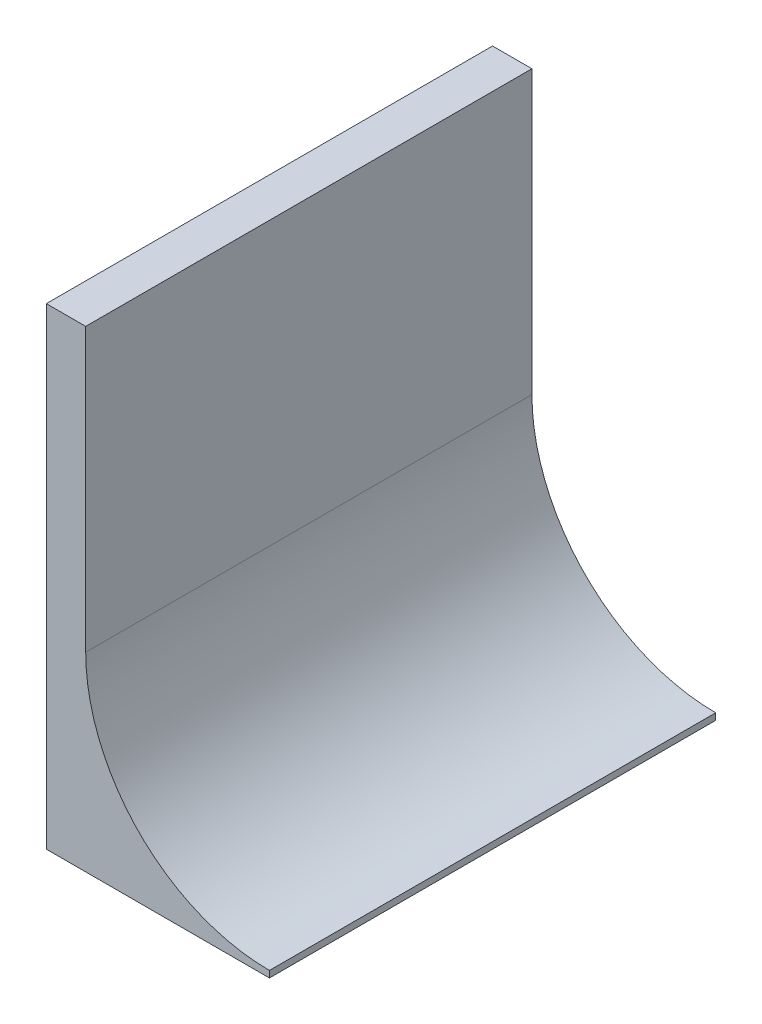
ISO-10303-21;
HEADER;
FILE_DESCRIPTION(('STEP AP214'),'2;1');
FILE_NAME('part.step','',(''),(''),'','','');
FILE_SCHEMA(('AUTOMOTIVE_DESIGN { 1 0 10303 214 1 1 1 1 }'));
ENDSEC;
DATA;
#1=APPLICATION_CONTEXT('core data for automotive mechanical design processes');
#2=APPLICATION_PROTOCOL_DEFINITION('international standard','automotive_design',2000,#1);
#3=PRODUCT_CONTEXT('',#1,'mechanical');
#4=PRODUCT('Part','Part','',(#3));
#5=PRODUCT_RELATED_PRODUCT_CATEGORY('part','',(#4));
#6=PRODUCT_DEFINITION_FORMATION('','',#4);
#7=PRODUCT_DEFINITION_CONTEXT('part definition',#1,'design');
#8=PRODUCT_DEFINITION('design','',#6,#7);
#9=PRODUCT_DEFINITION_SHAPE('','',#8);
#10=(LENGTH_UNIT() NAMED_UNIT(*) SI_UNIT(.MILLI.,.METRE.));
#11=(NAMED_UNIT(*) PLANE_ANGLE_UNIT() SI_UNIT($,.RADIAN.));
#12=(NAMED_UNIT(*) SI_UNIT($,.STERADIAN.) SOLID_ANGLE_UNIT());
#13=UNCERTAINTY_MEASURE_WITH_UNIT(LENGTH_MEASURE(1.E-05),#10,'distance_accuracy_value','');
#14=(GEOMETRIC_REPRESENTATION_CONTEXT(3) GLOBAL_UNCERTAINTY_ASSIGNED_CONTEXT((#13)) GLOBAL_UNIT_ASSIGNED_CONTEXT((#10,
#11,#12)) REPRESENTATION_CONTEXT('',''));
#15=CARTESIAN_POINT('',(0.,0.,0.));
#16=DIRECTION('',(0.,0.,1.));
#17=DIRECTION('',(1.,0.,0.));
#18=AXIS2_PLACEMENT_3D('',#15,#16,#17);
#19=CARTESIAN_POINT('',(-252.995998982065,139.7,-107.95));
#20=DIRECTION('',(0.,0.,1.));
#21=DIRECTION('',(0.,-1.,0.));
#22=AXIS2_PLACEMENT_3D('',#19,#20,#21);
#23=PLANE('',#22);
#24=DIRECTION('',(0.,1.,0.));
#25=VECTOR('',#24,1.);
#26=CARTESIAN_POINT('',(-379.995998982065,139.7,-107.95));
#27=LINE('',#26,#25);
#28=CARTESIAN_POINT('',(-379.995998982065,-139.7,-107.95));
#29=VERTEX_POINT('',#28);
#30=CARTESIAN_POINT('',(-379.995998982065,88.9000000000001,-107.95));
#31=VERTEX_POINT('',#30);
#32=EDGE_CURVE('E120',#29,#31,#27,.T.);
#33=ORIENTED_EDGE('',*,*,#32,.T.);
#34=DIRECTION('',(1.,0.,0.));
#35=VECTOR('',#34,1.);
#36=CARTESIAN_POINT('',(-379.995998982065,88.9000000000001,-107.95));
#37=LINE('',#36,#35);
#38=CARTESIAN_POINT('',(-360.945998982065,88.9000000000001,-107.95));
#39=VERTEX_POINT('',#38);
#40=EDGE_CURVE('E49',#31,#39,#37,.T.);
#41=ORIENTED_EDGE('',*,*,#40,.T.);
#42=DIRECTION('',(0.,-1.,0.));
#43=VECTOR('',#42,1.);
#44=CARTESIAN_POINT('',(-360.945998982065,88.9000000000001,-107.95));
#45=LINE('',#44,#43);
#46=CARTESIAN_POINT('',(-360.945998982065,-47.6249999999999,-107.95));
#47=VERTEX_POINT('',#46);
#48=EDGE_CURVE('E98',#39,#47,#45,.T.);
#49=ORIENTED_EDGE('',*,*,#48,.T.);
#50=CARTESIAN_POINT('',(-272.045998982065,-47.6249999999999,-107.95));
#51=DIRECTION('',(0.,0.,1.));
#52=DIRECTION('',(1.,0.,0.));
#53=AXIS2_PLACEMENT_3D('',#50,#51,#52);
#54=CIRCLE('',#53,88.9);
#55=CARTESIAN_POINT('',(-272.045998982065,-136.525,-107.95));
#56=VERTEX_POINT('',#55);
#57=EDGE_CURVE('E91',#47,#56,#54,.T.);
#58=ORIENTED_EDGE('',*,*,#57,.T.);
#59=DIRECTION('',(0.,-1.,0.));
#60=VECTOR('',#59,1.);
#61=CARTESIAN_POINT('',(-272.045998982065,-136.525,-107.95));
#62=LINE('',#61,#60);
#63=CARTESIAN_POINT('',(-272.045998982065,-139.7,-107.95));
#64=VERTEX_POINT('',#63);
#65=EDGE_CURVE('E100',#56,#64,#62,.T.);
#66=ORIENTED_EDGE('',*,*,#65,.T.);
#67=DIRECTION('',(-1.,0.,0.));
#68=VECTOR('',#67,1.);
#69=CARTESIAN_POINT('',(-252.995998982065,-139.7,-107.95));
#70=LINE('',#69,#68);
#71=EDGE_CURVE('E42',#64,#29,#70,.T.);
#72=ORIENTED_EDGE('',*,*,#71,.T.);
#73=EDGE_LOOP('',(#33,#41,#49,#58,#66,#72));
#74=FACE_BOUND('',#73,.T.);
#75=ADVANCED_FACE('F35',(#74),#23,.F.);
#76=CARTESIAN_POINT('',(-252.995998982065,139.7,107.95));
#77=DIRECTION('',(0.,0.,-1.));
#78=DIRECTION('',(0.,1.,0.));
#79=AXIS2_PLACEMENT_3D('',#76,#77,#78);
#80=PLANE('',#79);
#81=DIRECTION('',(0.,-1.,0.));
#82=VECTOR('',#81,1.);
#83=CARTESIAN_POINT('',(-360.945998982065,88.9000000000001,107.95));
#84=LINE('',#83,#82);
#85=CARTESIAN_POINT('',(-360.945998982065,88.9000000000001,107.95));
#86=VERTEX_POINT('',#85);
#87=CARTESIAN_POINT('',(-360.945998982065,-47.6249999999999,107.95));
#88=VERTEX_POINT('',#87);
#89=EDGE_CURVE('E105',#86,#88,#84,.T.);
#90=ORIENTED_EDGE('',*,*,#89,.F.);
#91=DIRECTION('',(1.,0.,0.));
#92=VECTOR('',#91,1.);
#93=CARTESIAN_POINT('',(-379.995998982065,88.9000000000001,107.95));
#94=LINE('',#93,#92);
#95=CARTESIAN_POINT('',(-379.995998982065,88.9000000000001,107.95));
#96=VERTEX_POINT('',#95);
#97=EDGE_CURVE('E108',#96,#86,#94,.T.);
#98=ORIENTED_EDGE('',*,*,#97,.F.);
#99=DIRECTION('',(0.,-1.,0.));
#100=VECTOR('',#99,1.);
#101=CARTESIAN_POINT('',(-379.995998982065,139.7,107.95));
#102=LINE('',#101,#100);
#103=CARTESIAN_POINT('',(-379.995998982065,-139.7,107.95));
#104=VERTEX_POINT('',#103);
#105=EDGE_CURVE('E127',#96,#104,#102,.T.);
#106=ORIENTED_EDGE('',*,*,#105,.T.);
#107=DIRECTION('',(-1.,0.,0.));
#108=VECTOR('',#107,1.);
#109=CARTESIAN_POINT('',(-252.995998982065,-139.7,107.95));
#110=LINE('',#109,#108);
#111=CARTESIAN_POINT('',(-272.045998982065,-139.7,107.95));
#112=VERTEX_POINT('',#111);
#113=EDGE_CURVE('E11',#112,#104,#110,.T.);
#114=ORIENTED_EDGE('',*,*,#113,.F.);
#115=DIRECTION('',(0.,-1.,0.));
#116=VECTOR('',#115,1.);
#117=CARTESIAN_POINT('',(-272.045998982065,-136.525,107.95));
#118=LINE('',#117,#116);
#119=CARTESIAN_POINT('',(-272.045998982065,-136.525,107.95));
#120=VERTEX_POINT('',#119);
#121=EDGE_CURVE('E114',#120,#112,#118,.T.);
#122=ORIENTED_EDGE('',*,*,#121,.F.);
#123=CARTESIAN_POINT('',(-272.045998982065,-47.6249999999999,107.95));
#124=DIRECTION('',(0.,0.,1.));
#125=DIRECTION('',(1.,0.,0.));
#126=AXIS2_PLACEMENT_3D('',#123,#124,#125);
#127=CIRCLE('',#126,88.9);
#128=EDGE_CURVE('E94',#88,#120,#127,.T.);
#129=ORIENTED_EDGE('',*,*,#128,.F.);
#130=EDGE_LOOP('',(#90,#98,#106,#114,#122,#129));
#131=FACE_BOUND('',#130,.T.);
#132=ADVANCED_FACE('F143',(#131),#80,.F.);
#133=CARTESIAN_POINT('',(-252.995998982065,-139.7,107.95));
#134=DIRECTION('',(0.,1.,0.));
#135=DIRECTION('',(0.,0.,1.));
#136=AXIS2_PLACEMENT_3D('',#133,#134,#135);
#137=PLANE('',#136);
#138=ORIENTED_EDGE('',*,*,#71,.F.);
#139=DIRECTION('',(0.,0.,1.));
#140=VECTOR('',#139,1.);
#141=CARTESIAN_POINT('',(-272.045998982065,-139.7,-107.95));
#142=LINE('',#141,#140);
#143=EDGE_CURVE('E97',#64,#112,#142,.T.);
#144=ORIENTED_EDGE('',*,*,#143,.T.);
#145=ORIENTED_EDGE('',*,*,#113,.T.);
#146=DIRECTION('',(0.,0.,-1.));
#147=VECTOR('',#146,1.);
#148=CARTESIAN_POINT('',(-379.995998982065,-139.7,107.95));
#149=LINE('',#148,#147);
#150=EDGE_CURVE('E130',#104,#29,#149,.T.);
#151=ORIENTED_EDGE('',*,*,#150,.T.);
#152=EDGE_LOOP('',(#138,#144,#145,#151));
#153=FACE_BOUND('',#152,.T.);
#154=ADVANCED_FACE('F134',(#153),#137,.F.);
#155=CARTESIAN_POINT('',(-379.995998982065,0.,0.));
#156=DIRECTION('',(1.,0.,0.));
#157=DIRECTION('',(0.,0.,-1.));
#158=AXIS2_PLACEMENT_3D('',#155,#156,#157);
#159=PLANE('',#158);
#160=ORIENTED_EDGE('',*,*,#105,.F.);
#161=DIRECTION('',(0.,0.,1.));
#162=VECTOR('',#161,1.);
#163=CARTESIAN_POINT('',(-379.995998982065,88.9000000000001,-107.95));
#164=LINE('',#163,#162);
#165=EDGE_CURVE('E123',#31,#96,#164,.T.);
#166=ORIENTED_EDGE('',*,*,#165,.F.);
#167=ORIENTED_EDGE('',*,*,#32,.F.);
#168=ORIENTED_EDGE('',*,*,#150,.F.);
#169=EDGE_LOOP('',(#160,#166,#167,#168));
#170=FACE_BOUND('',#169,.T.);
#171=ADVANCED_FACE('F138',(#170),#159,.F.);
#172=CARTESIAN_POINT('',(-272.045998982065,-47.6249999999999,-107.95));
#173=DIRECTION('',(0.,0.,1.));
#174=DIRECTION('',(1.,0.,0.));
#175=AXIS2_PLACEMENT_3D('',#172,#173,#174);
#176=CYLINDRICAL_SURFACE('',#175,88.9);
#177=ORIENTED_EDGE('',*,*,#128,.T.);
#178=DIRECTION('',(0.,0.,1.));
#179=VECTOR('',#178,1.);
#180=CARTESIAN_POINT('',(-272.045998982065,-136.525,-107.95));
#181=LINE('',#180,#179);
#182=EDGE_CURVE('E87',#56,#120,#181,.T.);
#183=ORIENTED_EDGE('',*,*,#182,.F.);
#184=ORIENTED_EDGE('',*,*,#57,.F.);
#185=DIRECTION('',(0.,0.,1.));
#186=VECTOR('',#185,1.);
#187=CARTESIAN_POINT('',(-360.945998982065,-47.6249999999999,-107.95));
#188=LINE('',#187,#186);
#189=EDGE_CURVE('E118',#47,#88,#188,.T.);
#190=ORIENTED_EDGE('',*,*,#189,.T.);
#191=EDGE_LOOP('',(#177,#183,#184,#190));
#192=FACE_BOUND('',#191,.T.);
#193=ADVANCED_FACE('F89',(#192),#176,.F.);
#194=CARTESIAN_POINT('',(-360.945998982065,88.9000000000001,-107.95));
#195=DIRECTION('',(-1.,0.,0.));
#196=DIRECTION('',(0.,0.,1.));
#197=AXIS2_PLACEMENT_3D('',#194,#195,#196);
#198=PLANE('',#197);
#199=ORIENTED_EDGE('',*,*,#89,.T.);
#200=ORIENTED_EDGE('',*,*,#189,.F.);
#201=ORIENTED_EDGE('',*,*,#48,.F.);
#202=DIRECTION('',(0.,0.,1.));
#203=VECTOR('',#202,1.);
#204=CARTESIAN_POINT('',(-360.945998982065,88.9000000000001,-107.95));
#205=LINE('',#204,#203);
#206=EDGE_CURVE('E121',#39,#86,#205,.T.);
#207=ORIENTED_EDGE('',*,*,#206,.T.);
#208=EDGE_LOOP('',(#199,#200,#201,#207));
#209=FACE_BOUND('',#208,.T.);
#210=ADVANCED_FACE('F145',(#209),#198,.F.);
#211=CARTESIAN_POINT('',(-379.995998982065,88.9000000000001,-107.95));
#212=DIRECTION('',(0.,-1.,0.));
#213=DIRECTION('',(0.,0.,-1.));
#214=AXIS2_PLACEMENT_3D('',#211,#212,#213);
#215=PLANE('',#214);
#216=ORIENTED_EDGE('',*,*,#97,.T.);
#217=ORIENTED_EDGE('',*,*,#206,.F.);
#218=ORIENTED_EDGE('',*,*,#40,.F.);
#219=ORIENTED_EDGE('',*,*,#165,.T.);
#220=EDGE_LOOP('',(#216,#217,#218,#219));
#221=FACE_BOUND('',#220,.T.);
#222=ADVANCED_FACE('F140',(#221),#215,.F.);
#223=CARTESIAN_POINT('',(-272.045998982065,-136.525,-107.95));
#224=DIRECTION('',(-1.,0.,0.));
#225=DIRECTION('',(0.,-1.,0.));
#226=AXIS2_PLACEMENT_3D('',#223,#224,#225);
#227=PLANE('',#226);
#228=ORIENTED_EDGE('',*,*,#121,.T.);
#229=ORIENTED_EDGE('',*,*,#143,.F.);
#230=ORIENTED_EDGE('',*,*,#65,.F.);
#231=ORIENTED_EDGE('',*,*,#182,.T.);
#232=EDGE_LOOP('',(#228,#229,#230,#231));
#233=FACE_BOUND('',#232,.T.);
#234=ADVANCED_FACE('F101',(#233),#227,.F.);
#235=CLOSED_SHELL('',(#75,#132,#154,#171,#193,#210,#222,#234));
#236=MANIFOLD_SOLID_BREP('B2',#235);
#237=ADVANCED_BREP_SHAPE_REPRESENTATION('',(#18,#236),#14);
#238=SHAPE_DEFINITION_REPRESENTATION(#9,#237);
ENDSEC;
END-ISO-10303-21;
